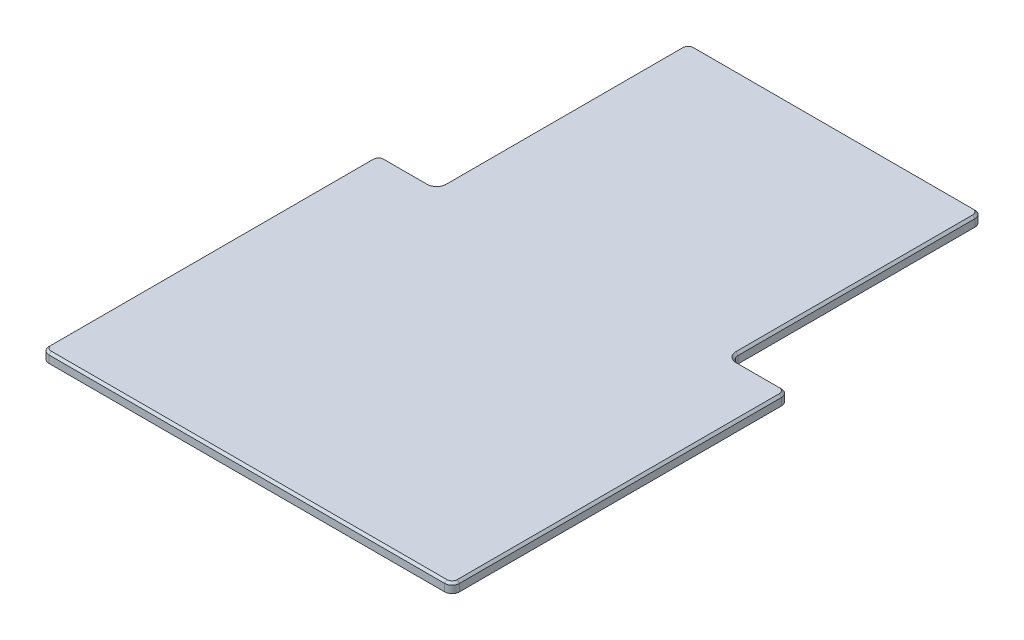
ISO-10303-21;
HEADER;
FILE_DESCRIPTION(('STEP AP214'),'2;1');
FILE_NAME('part.step','',(''),(''),'','','');
FILE_SCHEMA(('AUTOMOTIVE_DESIGN { 1 0 10303 214 1 1 1 1 }'));
ENDSEC;
DATA;
#1=APPLICATION_CONTEXT('core data for automotive mechanical design processes');
#2=APPLICATION_PROTOCOL_DEFINITION('international standard','automotive_design',2000,#1);
#3=PRODUCT_CONTEXT('',#1,'mechanical');
#4=PRODUCT('Part','Part','',(#3));
#5=PRODUCT_RELATED_PRODUCT_CATEGORY('part','',(#4));
#6=PRODUCT_DEFINITION_FORMATION('','',#4);
#7=PRODUCT_DEFINITION_CONTEXT('part definition',#1,'design');
#8=PRODUCT_DEFINITION('design','',#6,#7);
#9=PRODUCT_DEFINITION_SHAPE('','',#8);
#10=(LENGTH_UNIT() NAMED_UNIT(*) SI_UNIT(.MILLI.,.METRE.));
#11=(NAMED_UNIT(*) PLANE_ANGLE_UNIT() SI_UNIT($,.RADIAN.));
#12=(NAMED_UNIT(*) SI_UNIT($,.STERADIAN.) SOLID_ANGLE_UNIT());
#13=UNCERTAINTY_MEASURE_WITH_UNIT(LENGTH_MEASURE(1.E-05),#10,'distance_accuracy_value','');
#14=(GEOMETRIC_REPRESENTATION_CONTEXT(3) GLOBAL_UNCERTAINTY_ASSIGNED_CONTEXT((#13)) GLOBAL_UNIT_ASSIGNED_CONTEXT((#10,
#11,#12)) REPRESENTATION_CONTEXT('',''));
#15=CARTESIAN_POINT('',(0.,0.,0.));
#16=DIRECTION('',(0.,0.,1.));
#17=DIRECTION('',(1.,0.,0.));
#18=AXIS2_PLACEMENT_3D('',#15,#16,#17);
#19=CARTESIAN_POINT('',(469.,13.,-790.));
#20=DIRECTION('',(0.,-1.,0.));
#21=DIRECTION('',(0.,0.,-1.));
#22=AXIS2_PLACEMENT_3D('',#19,#20,#21);
#23=CYLINDRICAL_SURFACE('',#22,10.);
#24=DIRECTION('',(0.,-1.,0.));
#25=VECTOR('',#24,1.);
#26=CARTESIAN_POINT('',(469.,13.,-800.));
#27=LINE('',#26,#25);
#28=CARTESIAN_POINT('',(469.,10.0000000000002,-800.));
#29=VERTEX_POINT('',#28);
#30=CARTESIAN_POINT('',(469.,0.,-800.));
#31=VERTEX_POINT('',#30);
#32=EDGE_CURVE('E192',#29,#31,#27,.T.);
#33=ORIENTED_EDGE('',*,*,#32,.F.);
#34=CARTESIAN_POINT('',(469.,10.0000000000002,-790.));
#35=DIRECTION('',(0.,-1.,0.));
#36=DIRECTION('',(0.,0.,-1.));
#37=AXIS2_PLACEMENT_3D('',#34,#35,#36);
#38=CIRCLE('',#37,10.);
#39=CARTESIAN_POINT('',(479.,10.0000000000002,-790.));
#40=VERTEX_POINT('',#39);
#41=EDGE_CURVE('E345',#29,#40,#38,.T.);
#42=ORIENTED_EDGE('',*,*,#41,.T.);
#43=DIRECTION('',(0.,-1.,0.));
#44=VECTOR('',#43,1.);
#45=CARTESIAN_POINT('',(479.,13.,-790.));
#46=LINE('',#45,#44);
#47=CARTESIAN_POINT('',(479.,0.,-790.));
#48=VERTEX_POINT('',#47);
#49=EDGE_CURVE('E213',#40,#48,#46,.T.);
#50=ORIENTED_EDGE('',*,*,#49,.T.);
#51=CARTESIAN_POINT('',(469.,0.,-790.));
#52=DIRECTION('',(0.,1.,0.));
#53=DIRECTION('',(0.,0.,-1.));
#54=AXIS2_PLACEMENT_3D('',#51,#52,#53);
#55=CIRCLE('',#54,10.);
#56=EDGE_CURVE('E207',#48,#31,#55,.T.);
#57=ORIENTED_EDGE('',*,*,#56,.T.);
#58=EDGE_LOOP('',(#33,#42,#50,#57));
#59=FACE_BOUND('',#58,.T.);
#60=ADVANCED_FACE('F33',(#59),#23,.T.);
#61=CARTESIAN_POINT('',(89.0000000000001,13.,-800.));
#62=DIRECTION('',(0.,0.,1.));
#63=DIRECTION('',(1.,0.,0.));
#64=AXIS2_PLACEMENT_3D('',#61,#62,#63);
#65=PLANE('',#64);
#66=DIRECTION('',(0.,-1.,0.));
#67=VECTOR('',#66,1.);
#68=CARTESIAN_POINT('',(89.0000000000001,13.,-800.));
#69=LINE('',#68,#67);
#70=CARTESIAN_POINT('',(89.0000000000001,10.0000000000002,-800.));
#71=VERTEX_POINT('',#70);
#72=CARTESIAN_POINT('',(89.0000000000001,0.,-800.));
#73=VERTEX_POINT('',#72);
#74=EDGE_CURVE('E201',#71,#73,#69,.T.);
#75=ORIENTED_EDGE('',*,*,#74,.F.);
#76=DIRECTION('',(1.,0.,0.));
#77=VECTOR('',#76,1.);
#78=CARTESIAN_POINT('',(89.0000000000001,10.0000000000002,-800.));
#79=LINE('',#78,#77);
#80=EDGE_CURVE('E11',#71,#29,#79,.T.);
#81=ORIENTED_EDGE('',*,*,#80,.T.);
#82=ORIENTED_EDGE('',*,*,#32,.T.);
#83=DIRECTION('',(-1.,0.,0.));
#84=VECTOR('',#83,1.);
#85=CARTESIAN_POINT('',(89.0000000000001,0.,-800.));
#86=LINE('',#85,#84);
#87=EDGE_CURVE('E195',#31,#73,#86,.T.);
#88=ORIENTED_EDGE('',*,*,#87,.T.);
#89=EDGE_LOOP('',(#75,#81,#82,#88));
#90=FACE_BOUND('',#89,.T.);
#91=ADVANCED_FACE('F194',(#90),#65,.F.);
#92=CARTESIAN_POINT('',(89.,13.,-790.));
#93=DIRECTION('',(0.,-1.,0.));
#94=DIRECTION('',(0.,0.,-1.));
#95=AXIS2_PLACEMENT_3D('',#92,#93,#94);
#96=CYLINDRICAL_SURFACE('',#95,10.);
#97=DIRECTION('',(0.,-1.,0.));
#98=VECTOR('',#97,1.);
#99=CARTESIAN_POINT('',(79.,13.,-790.));
#100=LINE('',#99,#98);
#101=CARTESIAN_POINT('',(79.,10.0000000000002,-790.));
#102=VERTEX_POINT('',#101);
#103=CARTESIAN_POINT('',(79.,0.,-790.));
#104=VERTEX_POINT('',#103);
#105=EDGE_CURVE('E283',#102,#104,#100,.T.);
#106=ORIENTED_EDGE('',*,*,#105,.F.);
#107=CARTESIAN_POINT('',(89.,10.0000000000002,-790.));
#108=DIRECTION('',(0.,-1.,0.));
#109=DIRECTION('',(0.,0.,-1.));
#110=AXIS2_PLACEMENT_3D('',#107,#108,#109);
#111=CIRCLE('',#110,10.);
#112=EDGE_CURVE('E42',#102,#71,#111,.T.);
#113=ORIENTED_EDGE('',*,*,#112,.T.);
#114=ORIENTED_EDGE('',*,*,#74,.T.);
#115=CARTESIAN_POINT('',(89.,0.,-790.));
#116=DIRECTION('',(0.,1.,0.));
#117=DIRECTION('',(0.,0.,-1.));
#118=AXIS2_PLACEMENT_3D('',#115,#116,#117);
#119=CIRCLE('',#118,10.);
#120=EDGE_CURVE('E210',#73,#104,#119,.T.);
#121=ORIENTED_EDGE('',*,*,#120,.T.);
#122=EDGE_LOOP('',(#106,#113,#114,#121));
#123=FACE_BOUND('',#122,.T.);
#124=ADVANCED_FACE('F522',(#123),#96,.T.);
#125=CARTESIAN_POINT('',(79.,13.,-468.));
#126=DIRECTION('',(1.,0.,0.));
#127=DIRECTION('',(0.,0.,-1.));
#128=AXIS2_PLACEMENT_3D('',#125,#126,#127);
#129=PLANE('',#128);
#130=DIRECTION('',(0.,-1.,0.));
#131=VECTOR('',#130,1.);
#132=CARTESIAN_POINT('',(79.,13.,-468.));
#133=LINE('',#132,#131);
#134=CARTESIAN_POINT('',(79.,10.0000000000002,-468.));
#135=VERTEX_POINT('',#134);
#136=CARTESIAN_POINT('',(79.,0.,-468.));
#137=VERTEX_POINT('',#136);
#138=EDGE_CURVE('E281',#135,#137,#133,.T.);
#139=ORIENTED_EDGE('',*,*,#138,.F.);
#140=DIRECTION('',(0.,0.,-1.));
#141=VECTOR('',#140,1.);
#142=CARTESIAN_POINT('',(79.,10.,-468.));
#143=LINE('',#142,#141);
#144=EDGE_CURVE('E329',#135,#102,#143,.T.);
#145=ORIENTED_EDGE('',*,*,#144,.T.);
#146=ORIENTED_EDGE('',*,*,#105,.T.);
#147=DIRECTION('',(0.,0.,1.));
#148=VECTOR('',#147,1.);
#149=CARTESIAN_POINT('',(79.,0.,-468.));
#150=LINE('',#149,#148);
#151=EDGE_CURVE('E220',#104,#137,#150,.T.);
#152=ORIENTED_EDGE('',*,*,#151,.T.);
#153=EDGE_LOOP('',(#139,#145,#146,#152));
#154=FACE_BOUND('',#153,.T.);
#155=ADVANCED_FACE('F418',(#154),#129,.F.);
#156=CARTESIAN_POINT('',(69.,13.,-468.));
#157=DIRECTION('',(0.,-1.,0.));
#158=DIRECTION('',(0.,0.,-1.));
#159=AXIS2_PLACEMENT_3D('',#156,#157,#158);
#160=CYLINDRICAL_SURFACE('',#159,10.);
#161=DIRECTION('',(0.,-1.,0.));
#162=VECTOR('',#161,1.);
#163=CARTESIAN_POINT('',(68.9999999999999,13.,-458.));
#164=LINE('',#163,#162);
#165=CARTESIAN_POINT('',(68.9999999999999,10.0000000000002,-458.));
#166=VERTEX_POINT('',#165);
#167=CARTESIAN_POINT('',(68.9999999999999,0.,-458.));
#168=VERTEX_POINT('',#167);
#169=EDGE_CURVE('E279',#166,#168,#164,.T.);
#170=ORIENTED_EDGE('',*,*,#169,.F.);
#171=CARTESIAN_POINT('',(69.,10.0000000000002,-468.));
#172=DIRECTION('',(0.,-1.,0.));
#173=DIRECTION('',(0.,0.,-1.));
#174=AXIS2_PLACEMENT_3D('',#171,#172,#173);
#175=CIRCLE('',#174,10.);
#176=EDGE_CURVE('E343',#166,#135,#175,.F.);
#177=ORIENTED_EDGE('',*,*,#176,.T.);
#178=ORIENTED_EDGE('',*,*,#138,.T.);
#179=CARTESIAN_POINT('',(69.,0.,-468.));
#180=DIRECTION('',(0.,-1.,0.));
#181=DIRECTION('',(0.,0.,1.));
#182=AXIS2_PLACEMENT_3D('',#179,#180,#181);
#183=CIRCLE('',#182,10.);
#184=EDGE_CURVE('E223',#137,#168,#183,.T.);
#185=ORIENTED_EDGE('',*,*,#184,.T.);
#186=EDGE_LOOP('',(#170,#177,#178,#185));
#187=FACE_BOUND('',#186,.T.);
#188=ADVANCED_FACE('F416',(#187),#160,.F.);
#189=CARTESIAN_POINT('',(10.0000000000001,13.,-458.));
#190=DIRECTION('',(0.,0.,1.));
#191=DIRECTION('',(1.,0.,0.));
#192=AXIS2_PLACEMENT_3D('',#189,#190,#191);
#193=PLANE('',#192);
#194=DIRECTION('',(0.,-1.,0.));
#195=VECTOR('',#194,1.);
#196=CARTESIAN_POINT('',(10.0000000000001,13.,-458.));
#197=LINE('',#196,#195);
#198=CARTESIAN_POINT('',(10.0000000000001,10.0000000000002,-458.));
#199=VERTEX_POINT('',#198);
#200=CARTESIAN_POINT('',(10.0000000000001,0.,-458.));
#201=VERTEX_POINT('',#200);
#202=EDGE_CURVE('E277',#199,#201,#197,.T.);
#203=ORIENTED_EDGE('',*,*,#202,.F.);
#204=DIRECTION('',(1.,0.,0.));
#205=VECTOR('',#204,1.);
#206=CARTESIAN_POINT('',(10.0000000000001,10.0000000000002,-458.));
#207=LINE('',#206,#205);
#208=EDGE_CURVE('E339',#199,#166,#207,.T.);
#209=ORIENTED_EDGE('',*,*,#208,.T.);
#210=ORIENTED_EDGE('',*,*,#169,.T.);
#211=DIRECTION('',(-1.,0.,0.));
#212=VECTOR('',#211,1.);
#213=CARTESIAN_POINT('',(10.0000000000001,0.,-458.));
#214=LINE('',#213,#212);
#215=EDGE_CURVE('E226',#168,#201,#214,.T.);
#216=ORIENTED_EDGE('',*,*,#215,.T.);
#217=EDGE_LOOP('',(#203,#209,#210,#216));
#218=FACE_BOUND('',#217,.T.);
#219=ADVANCED_FACE('F425',(#218),#193,.F.);
#220=CARTESIAN_POINT('',(10.,13.,-448.));
#221=DIRECTION('',(0.,-1.,0.));
#222=DIRECTION('',(0.,0.,-1.));
#223=AXIS2_PLACEMENT_3D('',#220,#221,#222);
#224=CYLINDRICAL_SURFACE('',#223,10.);
#225=DIRECTION('',(0.,-1.,0.));
#226=VECTOR('',#225,1.);
#227=CARTESIAN_POINT('',(0.,13.,-448.));
#228=LINE('',#227,#226);
#229=CARTESIAN_POINT('',(0.,10.0000000000002,-448.));
#230=VERTEX_POINT('',#229);
#231=CARTESIAN_POINT('',(0.,0.,-448.));
#232=VERTEX_POINT('',#231);
#233=EDGE_CURVE('E275',#230,#232,#228,.T.);
#234=ORIENTED_EDGE('',*,*,#233,.F.);
#235=CARTESIAN_POINT('',(10.,10.0000000000002,-448.));
#236=DIRECTION('',(0.,-1.,0.));
#237=DIRECTION('',(0.,0.,-1.));
#238=AXIS2_PLACEMENT_3D('',#235,#236,#237);
#239=CIRCLE('',#238,10.);
#240=EDGE_CURVE('E337',#230,#199,#239,.T.);
#241=ORIENTED_EDGE('',*,*,#240,.T.);
#242=ORIENTED_EDGE('',*,*,#202,.T.);
#243=CARTESIAN_POINT('',(10.,0.,-448.));
#244=DIRECTION('',(0.,1.,0.));
#245=DIRECTION('',(0.,0.,-1.));
#246=AXIS2_PLACEMENT_3D('',#243,#244,#245);
#247=CIRCLE('',#246,10.);
#248=EDGE_CURVE('E229',#201,#232,#247,.T.);
#249=ORIENTED_EDGE('',*,*,#248,.T.);
#250=EDGE_LOOP('',(#234,#241,#242,#249));
#251=FACE_BOUND('',#250,.T.);
#252=ADVANCED_FACE('F428',(#251),#224,.T.);
#253=CARTESIAN_POINT('',(0.,13.,-10.0000000000001));
#254=DIRECTION('',(1.,0.,0.));
#255=DIRECTION('',(0.,0.,-1.));
#256=AXIS2_PLACEMENT_3D('',#253,#254,#255);
#257=PLANE('',#256);
#258=DIRECTION('',(0.,-1.,0.));
#259=VECTOR('',#258,1.);
#260=CARTESIAN_POINT('',(0.,13.,-10.0000000000001));
#261=LINE('',#260,#259);
#262=CARTESIAN_POINT('',(0.,10.0000000000002,-10.0000000000001));
#263=VERTEX_POINT('',#262);
#264=CARTESIAN_POINT('',(0.,0.,-10.0000000000001));
#265=VERTEX_POINT('',#264);
#266=EDGE_CURVE('E273',#263,#265,#261,.T.);
#267=ORIENTED_EDGE('',*,*,#266,.F.);
#268=DIRECTION('',(0.,0.,-1.));
#269=VECTOR('',#268,1.);
#270=CARTESIAN_POINT('',(0.,10.,-10.0000000000001));
#271=LINE('',#270,#269);
#272=EDGE_CURVE('E327',#263,#230,#271,.T.);
#273=ORIENTED_EDGE('',*,*,#272,.T.);
#274=ORIENTED_EDGE('',*,*,#233,.T.);
#275=DIRECTION('',(0.,0.,1.));
#276=VECTOR('',#275,1.);
#277=CARTESIAN_POINT('',(0.,0.,-10.0000000000001));
#278=LINE('',#277,#276);
#279=EDGE_CURVE('E232',#232,#265,#278,.T.);
#280=ORIENTED_EDGE('',*,*,#279,.T.);
#281=EDGE_LOOP('',(#267,#273,#274,#280));
#282=FACE_BOUND('',#281,.T.);
#283=ADVANCED_FACE('F431',(#282),#257,.F.);
#284=CARTESIAN_POINT('',(10.,13.,-10.));
#285=DIRECTION('',(0.,-1.,0.));
#286=DIRECTION('',(0.,0.,-1.));
#287=AXIS2_PLACEMENT_3D('',#284,#285,#286);
#288=CYLINDRICAL_SURFACE('',#287,10.);
#289=DIRECTION('',(0.,-1.,0.));
#290=VECTOR('',#289,1.);
#291=CARTESIAN_POINT('',(10.0000000000001,13.,0.));
#292=LINE('',#291,#290);
#293=CARTESIAN_POINT('',(10.0000000000001,10.0000000000002,0.));
#294=VERTEX_POINT('',#293);
#295=CARTESIAN_POINT('',(10.0000000000001,0.,0.));
#296=VERTEX_POINT('',#295);
#297=EDGE_CURVE('E271',#294,#296,#292,.T.);
#298=ORIENTED_EDGE('',*,*,#297,.F.);
#299=CARTESIAN_POINT('',(10.,10.0000000000002,-10.));
#300=DIRECTION('',(0.,-1.,0.));
#301=DIRECTION('',(0.,0.,-1.));
#302=AXIS2_PLACEMENT_3D('',#299,#300,#301);
#303=CIRCLE('',#302,10.);
#304=EDGE_CURVE('E333',#294,#263,#303,.T.);
#305=ORIENTED_EDGE('',*,*,#304,.T.);
#306=ORIENTED_EDGE('',*,*,#266,.T.);
#307=CARTESIAN_POINT('',(10.,0.,-10.));
#308=DIRECTION('',(0.,1.,0.));
#309=DIRECTION('',(0.,0.,-1.));
#310=AXIS2_PLACEMENT_3D('',#307,#308,#309);
#311=CIRCLE('',#310,10.);
#312=EDGE_CURVE('E235',#265,#296,#311,.T.);
#313=ORIENTED_EDGE('',*,*,#312,.T.);
#314=EDGE_LOOP('',(#298,#305,#306,#313));
#315=FACE_BOUND('',#314,.T.);
#316=ADVANCED_FACE('F435',(#315),#288,.T.);
#317=CARTESIAN_POINT('',(10.0000000000001,13.,0.));
#318=DIRECTION('',(0.,0.,-1.));
#319=DIRECTION('',(-1.,0.,0.));
#320=AXIS2_PLACEMENT_3D('',#317,#318,#319);
#321=PLANE('',#320);
#322=DIRECTION('',(0.,-1.,0.));
#323=VECTOR('',#322,1.);
#324=CARTESIAN_POINT('',(548.,13.,0.));
#325=LINE('',#324,#323);
#326=CARTESIAN_POINT('',(548.,10.0000000000002,0.));
#327=VERTEX_POINT('',#326);
#328=CARTESIAN_POINT('',(548.,0.,0.));
#329=VERTEX_POINT('',#328);
#330=EDGE_CURVE('E269',#327,#329,#325,.T.);
#331=ORIENTED_EDGE('',*,*,#330,.F.);
#332=DIRECTION('',(-1.,0.,0.));
#333=VECTOR('',#332,1.);
#334=CARTESIAN_POINT('',(10.0000000000001,10.,0.));
#335=LINE('',#334,#333);
#336=EDGE_CURVE('E325',#327,#294,#335,.T.);
#337=ORIENTED_EDGE('',*,*,#336,.T.);
#338=ORIENTED_EDGE('',*,*,#297,.T.);
#339=DIRECTION('',(1.,0.,0.));
#340=VECTOR('',#339,1.);
#341=CARTESIAN_POINT('',(10.0000000000001,0.,0.));
#342=LINE('',#341,#340);
#343=EDGE_CURVE('E238',#296,#329,#342,.T.);
#344=ORIENTED_EDGE('',*,*,#343,.T.);
#345=EDGE_LOOP('',(#331,#337,#338,#344));
#346=FACE_BOUND('',#345,.T.);
#347=ADVANCED_FACE('F508',(#346),#321,.F.);
#348=CARTESIAN_POINT('',(548.,13.,-10.));
#349=DIRECTION('',(0.,-1.,0.));
#350=DIRECTION('',(0.,0.,-1.));
#351=AXIS2_PLACEMENT_3D('',#348,#349,#350);
#352=CYLINDRICAL_SURFACE('',#351,10.);
#353=DIRECTION('',(0.,-1.,0.));
#354=VECTOR('',#353,1.);
#355=CARTESIAN_POINT('',(558.,13.,-10.0000000000001));
#356=LINE('',#355,#354);
#357=CARTESIAN_POINT('',(558.,10.0000000000002,-10.0000000000001));
#358=VERTEX_POINT('',#357);
#359=CARTESIAN_POINT('',(558.,0.,-10.0000000000001));
#360=VERTEX_POINT('',#359);
#361=EDGE_CURVE('E267',#358,#360,#356,.T.);
#362=ORIENTED_EDGE('',*,*,#361,.F.);
#363=CARTESIAN_POINT('',(548.,10.0000000000002,-10.));
#364=DIRECTION('',(0.,-1.,0.));
#365=DIRECTION('',(0.,0.,-1.));
#366=AXIS2_PLACEMENT_3D('',#363,#364,#365);
#367=CIRCLE('',#366,10.);
#368=EDGE_CURVE('E331',#358,#327,#367,.T.);
#369=ORIENTED_EDGE('',*,*,#368,.T.);
#370=ORIENTED_EDGE('',*,*,#330,.T.);
#371=CARTESIAN_POINT('',(548.,0.,-10.));
#372=DIRECTION('',(0.,1.,0.));
#373=DIRECTION('',(0.,0.,1.));
#374=AXIS2_PLACEMENT_3D('',#371,#372,#373);
#375=CIRCLE('',#374,10.);
#376=EDGE_CURVE('E241',#329,#360,#375,.T.);
#377=ORIENTED_EDGE('',*,*,#376,.T.);
#378=EDGE_LOOP('',(#362,#369,#370,#377));
#379=FACE_BOUND('',#378,.T.);
#380=ADVANCED_FACE('F505',(#379),#352,.T.);
#381=CARTESIAN_POINT('',(558.,13.,-10.0000000000001));
#382=DIRECTION('',(-1.,0.,0.));
#383=DIRECTION('',(0.,0.,1.));
#384=AXIS2_PLACEMENT_3D('',#381,#382,#383);
#385=PLANE('',#384);
#386=DIRECTION('',(0.,-1.,0.));
#387=VECTOR('',#386,1.);
#388=CARTESIAN_POINT('',(558.,13.,-448.));
#389=LINE('',#388,#387);
#390=CARTESIAN_POINT('',(558.,10.0000000000002,-448.));
#391=VERTEX_POINT('',#390);
#392=CARTESIAN_POINT('',(558.,0.,-448.));
#393=VERTEX_POINT('',#392);
#394=EDGE_CURVE('E265',#391,#393,#389,.T.);
#395=ORIENTED_EDGE('',*,*,#394,.F.);
#396=DIRECTION('',(0.,0.,1.));
#397=VECTOR('',#396,1.);
#398=CARTESIAN_POINT('',(558.,10.0000000000002,-10.0000000000001));
#399=LINE('',#398,#397);
#400=EDGE_CURVE('E323',#391,#358,#399,.T.);
#401=ORIENTED_EDGE('',*,*,#400,.T.);
#402=ORIENTED_EDGE('',*,*,#361,.T.);
#403=DIRECTION('',(0.,0.,-1.));
#404=VECTOR('',#403,1.);
#405=CARTESIAN_POINT('',(558.,0.,-10.0000000000001));
#406=LINE('',#405,#404);
#407=EDGE_CURVE('E244',#360,#393,#406,.T.);
#408=ORIENTED_EDGE('',*,*,#407,.T.);
#409=EDGE_LOOP('',(#395,#401,#402,#408));
#410=FACE_BOUND('',#409,.T.);
#411=ADVANCED_FACE('F502',(#410),#385,.F.);
#412=CARTESIAN_POINT('',(548.,13.,-448.));
#413=DIRECTION('',(0.,-1.,0.));
#414=DIRECTION('',(0.,0.,-1.));
#415=AXIS2_PLACEMENT_3D('',#412,#413,#414);
#416=CYLINDRICAL_SURFACE('',#415,10.);
#417=DIRECTION('',(0.,-1.,0.));
#418=VECTOR('',#417,1.);
#419=CARTESIAN_POINT('',(548.,13.,-458.));
#420=LINE('',#419,#418);
#421=CARTESIAN_POINT('',(548.,10.0000000000002,-458.));
#422=VERTEX_POINT('',#421);
#423=CARTESIAN_POINT('',(548.,0.,-458.));
#424=VERTEX_POINT('',#423);
#425=EDGE_CURVE('E263',#422,#424,#420,.T.);
#426=ORIENTED_EDGE('',*,*,#425,.F.);
#427=CARTESIAN_POINT('',(548.,10.0000000000002,-448.));
#428=DIRECTION('',(0.,-1.,0.));
#429=DIRECTION('',(0.,0.,-1.));
#430=AXIS2_PLACEMENT_3D('',#427,#428,#429);
#431=CIRCLE('',#430,10.);
#432=EDGE_CURVE('E335',#422,#391,#431,.T.);
#433=ORIENTED_EDGE('',*,*,#432,.T.);
#434=ORIENTED_EDGE('',*,*,#394,.T.);
#435=CARTESIAN_POINT('',(548.,0.,-448.));
#436=DIRECTION('',(0.,1.,0.));
#437=DIRECTION('',(0.,0.,-1.));
#438=AXIS2_PLACEMENT_3D('',#435,#436,#437);
#439=CIRCLE('',#438,10.);
#440=EDGE_CURVE('E247',#393,#424,#439,.T.);
#441=ORIENTED_EDGE('',*,*,#440,.T.);
#442=EDGE_LOOP('',(#426,#433,#434,#441));
#443=FACE_BOUND('',#442,.T.);
#444=ADVANCED_FACE('F497',(#443),#416,.T.);
#445=CARTESIAN_POINT('',(489.,13.,-458.));
#446=DIRECTION('',(0.,0.,1.));
#447=DIRECTION('',(1.,0.,0.));
#448=AXIS2_PLACEMENT_3D('',#445,#446,#447);
#449=PLANE('',#448);
#450=DIRECTION('',(0.,-1.,0.));
#451=VECTOR('',#450,1.);
#452=CARTESIAN_POINT('',(489.,13.,-458.));
#453=LINE('',#452,#451);
#454=CARTESIAN_POINT('',(489.,10.0000000000002,-458.));
#455=VERTEX_POINT('',#454);
#456=CARTESIAN_POINT('',(489.,0.,-458.));
#457=VERTEX_POINT('',#456);
#458=EDGE_CURVE('E261',#455,#457,#453,.T.);
#459=ORIENTED_EDGE('',*,*,#458,.F.);
#460=DIRECTION('',(1.,0.,0.));
#461=VECTOR('',#460,1.);
#462=CARTESIAN_POINT('',(489.,10.0000000000002,-458.));
#463=LINE('',#462,#461);
#464=EDGE_CURVE('E321',#455,#422,#463,.T.);
#465=ORIENTED_EDGE('',*,*,#464,.T.);
#466=ORIENTED_EDGE('',*,*,#425,.T.);
#467=DIRECTION('',(-1.,0.,0.));
#468=VECTOR('',#467,1.);
#469=CARTESIAN_POINT('',(489.,0.,-458.));
#470=LINE('',#469,#468);
#471=EDGE_CURVE('E250',#424,#457,#470,.T.);
#472=ORIENTED_EDGE('',*,*,#471,.T.);
#473=EDGE_LOOP('',(#459,#465,#466,#472));
#474=FACE_BOUND('',#473,.T.);
#475=ADVANCED_FACE('F494',(#474),#449,.F.);
#476=CARTESIAN_POINT('',(489.,13.,-468.));
#477=DIRECTION('',(0.,-1.,0.));
#478=DIRECTION('',(0.,0.,-1.));
#479=AXIS2_PLACEMENT_3D('',#476,#477,#478);
#480=CYLINDRICAL_SURFACE('',#479,10.);
#481=DIRECTION('',(0.,-1.,0.));
#482=VECTOR('',#481,1.);
#483=CARTESIAN_POINT('',(479.,13.,-468.));
#484=LINE('',#483,#482);
#485=CARTESIAN_POINT('',(479.,10.0000000000002,-468.));
#486=VERTEX_POINT('',#485);
#487=CARTESIAN_POINT('',(479.,0.,-468.));
#488=VERTEX_POINT('',#487);
#489=EDGE_CURVE('E259',#486,#488,#484,.T.);
#490=ORIENTED_EDGE('',*,*,#489,.F.);
#491=CARTESIAN_POINT('',(489.,10.0000000000002,-468.));
#492=DIRECTION('',(0.,-1.,0.));
#493=DIRECTION('',(0.,0.,-1.));
#494=AXIS2_PLACEMENT_3D('',#491,#492,#493);
#495=CIRCLE('',#494,10.);
#496=EDGE_CURVE('E341',#486,#455,#495,.F.);
#497=ORIENTED_EDGE('',*,*,#496,.T.);
#498=ORIENTED_EDGE('',*,*,#458,.T.);
#499=CARTESIAN_POINT('',(489.,0.,-468.));
#500=DIRECTION('',(0.,-1.,0.));
#501=DIRECTION('',(0.,0.,1.));
#502=AXIS2_PLACEMENT_3D('',#499,#500,#501);
#503=CIRCLE('',#502,10.);
#504=EDGE_CURVE('E253',#457,#488,#503,.T.);
#505=ORIENTED_EDGE('',*,*,#504,.T.);
#506=EDGE_LOOP('',(#490,#497,#498,#505));
#507=FACE_BOUND('',#506,.T.);
#508=ADVANCED_FACE('F491',(#507),#480,.F.);
#509=CARTESIAN_POINT('',(479.,13.,-468.));
#510=DIRECTION('',(-1.,0.,0.));
#511=DIRECTION('',(0.,0.,1.));
#512=AXIS2_PLACEMENT_3D('',#509,#510,#511);
#513=PLANE('',#512);
#514=ORIENTED_EDGE('',*,*,#49,.F.);
#515=DIRECTION('',(0.,0.,1.));
#516=VECTOR('',#515,1.);
#517=CARTESIAN_POINT('',(479.,9.99999999999989,-468.));
#518=LINE('',#517,#516);
#519=EDGE_CURVE('E318',#40,#486,#518,.T.);
#520=ORIENTED_EDGE('',*,*,#519,.T.);
#521=ORIENTED_EDGE('',*,*,#489,.T.);
#522=DIRECTION('',(0.,0.,-1.));
#523=VECTOR('',#522,1.);
#524=CARTESIAN_POINT('',(479.,0.,-468.));
#525=LINE('',#524,#523);
#526=EDGE_CURVE('E256',#488,#48,#525,.T.);
#527=ORIENTED_EDGE('',*,*,#526,.T.);
#528=EDGE_LOOP('',(#514,#520,#521,#527));
#529=FACE_BOUND('',#528,.T.);
#530=ADVANCED_FACE('F485',(#529),#513,.F.);
#531=CARTESIAN_POINT('',(469.,13.,-790.));
#532=DIRECTION('',(0.,-1.,0.));
#533=DIRECTION('',(0.,0.,-1.));
#534=AXIS2_PLACEMENT_3D('',#531,#532,#533);
#535=PLANE('',#534);
#536=DIRECTION('',(1.,0.,0.));
#537=VECTOR('',#536,1.);
#538=CARTESIAN_POINT('',(469.,13.,-3.));
#539=LINE('',#538,#537);
#540=CARTESIAN_POINT('',(10.0000000000001,13.,-2.99999999999978));
#541=VERTEX_POINT('',#540);
#542=CARTESIAN_POINT('',(548.,13.,-3.));
#543=VERTEX_POINT('',#542);
#544=EDGE_CURVE('E312',#541,#543,#539,.T.);
#545=ORIENTED_EDGE('',*,*,#544,.T.);
#546=CARTESIAN_POINT('',(548.,13.,-10.));
#547=DIRECTION('',(0.,-1.,0.));
#548=DIRECTION('',(0.,0.,-1.));
#549=AXIS2_PLACEMENT_3D('',#546,#547,#548);
#550=CIRCLE('',#549,7.00000000000023);
#551=CARTESIAN_POINT('',(555.,13.,-10.0000000000001));
#552=VERTEX_POINT('',#551);
#553=EDGE_CURVE('E316',#543,#552,#550,.F.);
#554=ORIENTED_EDGE('',*,*,#553,.T.);
#555=DIRECTION('',(0.,0.,-1.));
#556=VECTOR('',#555,1.);
#557=CARTESIAN_POINT('',(555.,13.,-790.));
#558=LINE('',#557,#556);
#559=CARTESIAN_POINT('',(555.,13.,-448.));
#560=VERTEX_POINT('',#559);
#561=EDGE_CURVE('E314',#552,#560,#558,.T.);
#562=ORIENTED_EDGE('',*,*,#561,.T.);
#563=CARTESIAN_POINT('',(548.,13.,-448.));
#564=DIRECTION('',(0.,-1.,0.));
#565=DIRECTION('',(0.,0.,-1.));
#566=AXIS2_PLACEMENT_3D('',#563,#564,#565);
#567=CIRCLE('',#566,7.00000000000023);
#568=CARTESIAN_POINT('',(548.,13.,-455.));
#569=VERTEX_POINT('',#568);
#570=EDGE_CURVE('E308',#560,#569,#567,.F.);
#571=ORIENTED_EDGE('',*,*,#570,.T.);
#572=DIRECTION('',(-1.,0.,0.));
#573=VECTOR('',#572,1.);
#574=CARTESIAN_POINT('',(469.,13.,-455.));
#575=LINE('',#574,#573);
#576=CARTESIAN_POINT('',(489.,13.,-455.));
#577=VERTEX_POINT('',#576);
#578=EDGE_CURVE('E306',#569,#577,#575,.T.);
#579=ORIENTED_EDGE('',*,*,#578,.T.);
#580=CARTESIAN_POINT('',(489.,13.,-468.));
#581=DIRECTION('',(0.,-1.,0.));
#582=DIRECTION('',(0.,0.,-1.));
#583=AXIS2_PLACEMENT_3D('',#580,#581,#582);
#584=CIRCLE('',#583,12.9999999999998);
#585=CARTESIAN_POINT('',(476.,13.,-468.));
#586=VERTEX_POINT('',#585);
#587=EDGE_CURVE('E298',#577,#586,#584,.T.);
#588=ORIENTED_EDGE('',*,*,#587,.T.);
#589=DIRECTION('',(0.,0.,-1.));
#590=VECTOR('',#589,1.);
#591=CARTESIAN_POINT('',(476.,13.,-790.));
#592=LINE('',#591,#590);
#593=CARTESIAN_POINT('',(476.,13.,-790.));
#594=VERTEX_POINT('',#593);
#595=EDGE_CURVE('E293',#586,#594,#592,.T.);
#596=ORIENTED_EDGE('',*,*,#595,.T.);
#597=CARTESIAN_POINT('',(469.,13.,-790.));
#598=DIRECTION('',(0.,-1.,0.));
#599=DIRECTION('',(0.,0.,-1.));
#600=AXIS2_PLACEMENT_3D('',#597,#598,#599);
#601=CIRCLE('',#600,7.00000000000023);
#602=CARTESIAN_POINT('',(469.,13.,-797.));
#603=VERTEX_POINT('',#602);
#604=EDGE_CURVE('E289',#594,#603,#601,.F.);
#605=ORIENTED_EDGE('',*,*,#604,.T.);
#606=DIRECTION('',(-1.,0.,0.));
#607=VECTOR('',#606,1.);
#608=CARTESIAN_POINT('',(469.,13.,-797.));
#609=LINE('',#608,#607);
#610=CARTESIAN_POINT('',(89.0000000000001,13.,-797.));
#611=VERTEX_POINT('',#610);
#612=EDGE_CURVE('E200',#603,#611,#609,.T.);
#613=ORIENTED_EDGE('',*,*,#612,.T.);
#614=CARTESIAN_POINT('',(89.,13.,-790.));
#615=DIRECTION('',(0.,-1.,0.));
#616=DIRECTION('',(0.,0.,-1.));
#617=AXIS2_PLACEMENT_3D('',#614,#615,#616);
#618=CIRCLE('',#617,7.00000000000023);
#619=CARTESIAN_POINT('',(81.9999999999998,13.,-790.));
#620=VERTEX_POINT('',#619);
#621=EDGE_CURVE('E287',#611,#620,#618,.F.);
#622=ORIENTED_EDGE('',*,*,#621,.T.);
#623=DIRECTION('',(0.,0.,1.));
#624=VECTOR('',#623,1.);
#625=CARTESIAN_POINT('',(82.,13.,-790.));
#626=LINE('',#625,#624);
#627=CARTESIAN_POINT('',(82.,13.,-468.));
#628=VERTEX_POINT('',#627);
#629=EDGE_CURVE('E291',#620,#628,#626,.T.);
#630=ORIENTED_EDGE('',*,*,#629,.T.);
#631=CARTESIAN_POINT('',(69.,13.,-468.));
#632=DIRECTION('',(0.,-1.,0.));
#633=DIRECTION('',(0.,0.,-1.));
#634=AXIS2_PLACEMENT_3D('',#631,#632,#633);
#635=CIRCLE('',#634,12.9999999999998);
#636=CARTESIAN_POINT('',(68.9999999999999,13.,-455.));
#637=VERTEX_POINT('',#636);
#638=EDGE_CURVE('E296',#628,#637,#635,.T.);
#639=ORIENTED_EDGE('',*,*,#638,.T.);
#640=DIRECTION('',(-1.,0.,0.));
#641=VECTOR('',#640,1.);
#642=CARTESIAN_POINT('',(469.,13.,-455.));
#643=LINE('',#642,#641);
#644=CARTESIAN_POINT('',(10.,13.,-455.));
#645=VERTEX_POINT('',#644);
#646=EDGE_CURVE('E300',#637,#645,#643,.T.);
#647=ORIENTED_EDGE('',*,*,#646,.T.);
#648=CARTESIAN_POINT('',(10.,13.,-448.));
#649=DIRECTION('',(0.,-1.,0.));
#650=DIRECTION('',(0.,0.,-1.));
#651=AXIS2_PLACEMENT_3D('',#648,#649,#650);
#652=CIRCLE('',#651,7.00000000000023);
#653=CARTESIAN_POINT('',(2.99999999999977,13.,-448.));
#654=VERTEX_POINT('',#653);
#655=EDGE_CURVE('E302',#645,#654,#652,.F.);
#656=ORIENTED_EDGE('',*,*,#655,.T.);
#657=DIRECTION('',(0.,0.,1.));
#658=VECTOR('',#657,1.);
#659=CARTESIAN_POINT('',(3.,13.,-790.));
#660=LINE('',#659,#658);
#661=CARTESIAN_POINT('',(3.,13.,-10.0000000000001));
#662=VERTEX_POINT('',#661);
#663=EDGE_CURVE('E304',#654,#662,#660,.T.);
#664=ORIENTED_EDGE('',*,*,#663,.T.);
#665=CARTESIAN_POINT('',(10.,13.,-10.));
#666=DIRECTION('',(0.,-1.,0.));
#667=DIRECTION('',(0.,0.,-1.));
#668=AXIS2_PLACEMENT_3D('',#665,#666,#667);
#669=CIRCLE('',#668,7.00000000000022);
#670=EDGE_CURVE('E310',#662,#541,#669,.F.);
#671=ORIENTED_EDGE('',*,*,#670,.T.);
#672=EDGE_LOOP('',(#545,#554,#562,#571,#579,#588,#596,#605,#613,#622,#630,#639,#647,#656,#664,#671));
#673=FACE_BOUND('',#672,.T.);
#674=ADVANCED_FACE('F400',(#673),#535,.F.);
#675=CARTESIAN_POINT('',(469.,0.,-790.));
#676=DIRECTION('',(0.,-1.,0.));
#677=DIRECTION('',(0.,0.,-1.));
#678=AXIS2_PLACEMENT_3D('',#675,#676,#677);
#679=PLANE('',#678);
#680=ORIENTED_EDGE('',*,*,#56,.F.);
#681=ORIENTED_EDGE('',*,*,#526,.F.);
#682=ORIENTED_EDGE('',*,*,#504,.F.);
#683=ORIENTED_EDGE('',*,*,#471,.F.);
#684=ORIENTED_EDGE('',*,*,#440,.F.);
#685=ORIENTED_EDGE('',*,*,#407,.F.);
#686=ORIENTED_EDGE('',*,*,#376,.F.);
#687=ORIENTED_EDGE('',*,*,#343,.F.);
#688=ORIENTED_EDGE('',*,*,#312,.F.);
#689=ORIENTED_EDGE('',*,*,#279,.F.);
#690=ORIENTED_EDGE('',*,*,#248,.F.);
#691=ORIENTED_EDGE('',*,*,#215,.F.);
#692=ORIENTED_EDGE('',*,*,#184,.F.);
#693=ORIENTED_EDGE('',*,*,#151,.F.);
#694=ORIENTED_EDGE('',*,*,#120,.F.);
#695=ORIENTED_EDGE('',*,*,#87,.F.);
#696=EDGE_LOOP('',(#680,#681,#682,#683,#684,#685,#686,#687,#688,#689,#690,#691,#692,#693,#694,#695));
#697=FACE_BOUND('',#696,.T.);
#698=ADVANCED_FACE('F205',(#697),#679,.T.);
#699=CARTESIAN_POINT('',(3.,13.,-790.));
#700=DIRECTION('',(0.707106781186547,-0.707106781186547,0.));
#701=DIRECTION('',(0.707106781186548,0.707106781186548,0.));
#702=AXIS2_PLACEMENT_3D('',#699,#700,#701);
#703=PLANE('',#702);
#704=DIRECTION('',(0.707106781186547,0.707106781186547,0.));
#705=VECTOR('',#704,1.);
#706=CARTESIAN_POINT('',(0.,10.,-448.));
#707=LINE('',#706,#705);
#708=EDGE_CURVE('E217',#230,#654,#707,.T.);
#709=ORIENTED_EDGE('',*,*,#708,.F.);
#710=ORIENTED_EDGE('',*,*,#272,.F.);
#711=DIRECTION('',(-0.707106781186547,-0.707106781186547,0.));
#712=VECTOR('',#711,1.);
#713=CARTESIAN_POINT('',(3.,13.,-10.0000000000001));
#714=LINE('',#713,#712);
#715=EDGE_CURVE('E37',#662,#263,#714,.T.);
#716=ORIENTED_EDGE('',*,*,#715,.F.);
#717=ORIENTED_EDGE('',*,*,#663,.F.);
#718=EDGE_LOOP('',(#709,#710,#716,#717));
#719=FACE_BOUND('',#718,.T.);
#720=ADVANCED_FACE('F35',(#719),#703,.F.);
#721=CARTESIAN_POINT('',(10.,13.,-10.));
#722=DIRECTION('',(0.,-1.,0.));
#723=DIRECTION('',(0.,0.,-1.));
#724=AXIS2_PLACEMENT_3D('',#721,#722,#723);
#725=CONICAL_SURFACE('',#724,7.00000000000022,0.785398163397448);
#726=ORIENTED_EDGE('',*,*,#715,.T.);
#727=ORIENTED_EDGE('',*,*,#304,.F.);
#728=DIRECTION('',(0.,-0.707106781186547,0.707106781186547));
#729=VECTOR('',#728,1.);
#730=CARTESIAN_POINT('',(10.0000000000001,13.,-2.99999999999978));
#731=LINE('',#730,#729);
#732=EDGE_CURVE('E385',#541,#294,#731,.T.);
#733=ORIENTED_EDGE('',*,*,#732,.F.);
#734=ORIENTED_EDGE('',*,*,#670,.F.);
#735=EDGE_LOOP('',(#726,#727,#733,#734));
#736=FACE_BOUND('',#735,.T.);
#737=ADVANCED_FACE('F439',(#736),#725,.T.);
#738=CARTESIAN_POINT('',(10.,13.,-448.));
#739=DIRECTION('',(0.,-1.,0.));
#740=DIRECTION('',(0.,0.,-1.));
#741=AXIS2_PLACEMENT_3D('',#738,#739,#740);
#742=CONICAL_SURFACE('',#741,7.00000000000023,0.785398163397448);
#743=ORIENTED_EDGE('',*,*,#708,.T.);
#744=ORIENTED_EDGE('',*,*,#655,.F.);
#745=DIRECTION('',(0.,0.707106781186547,0.707106781186547));
#746=VECTOR('',#745,1.);
#747=CARTESIAN_POINT('',(10.0000000000001,10.0000000000002,-458.));
#748=LINE('',#747,#746);
#749=EDGE_CURVE('E382',#199,#645,#748,.T.);
#750=ORIENTED_EDGE('',*,*,#749,.F.);
#751=ORIENTED_EDGE('',*,*,#240,.F.);
#752=EDGE_LOOP('',(#743,#744,#750,#751));
#753=FACE_BOUND('',#752,.T.);
#754=ADVANCED_FACE('F392',(#753),#742,.T.);
#755=CARTESIAN_POINT('',(469.,13.,-3.));
#756=DIRECTION('',(0.,-0.707106781186547,-0.707106781186547));
#757=DIRECTION('',(0.,0.707106781186548,-0.707106781186548));
#758=AXIS2_PLACEMENT_3D('',#755,#756,#757);
#759=PLANE('',#758);
#760=ORIENTED_EDGE('',*,*,#732,.T.);
#761=ORIENTED_EDGE('',*,*,#336,.F.);
#762=DIRECTION('',(0.,-0.707106781186547,0.707106781186547));
#763=VECTOR('',#762,1.);
#764=CARTESIAN_POINT('',(548.,13.,-3.));
#765=LINE('',#764,#763);
#766=EDGE_CURVE('E379',#543,#327,#765,.T.);
#767=ORIENTED_EDGE('',*,*,#766,.F.);
#768=ORIENTED_EDGE('',*,*,#544,.F.);
#769=EDGE_LOOP('',(#760,#761,#767,#768));
#770=FACE_BOUND('',#769,.T.);
#771=ADVANCED_FACE('F443',(#770),#759,.F.);
#772=CARTESIAN_POINT('',(469.,13.,-455.));
#773=DIRECTION('',(0.,-0.707106781186547,0.707106781186547));
#774=DIRECTION('',(0.,-0.707106781186548,-0.707106781186548));
#775=AXIS2_PLACEMENT_3D('',#772,#773,#774);
#776=PLANE('',#775);
#777=ORIENTED_EDGE('',*,*,#749,.T.);
#778=ORIENTED_EDGE('',*,*,#646,.F.);
#779=DIRECTION('',(0.,0.707106781186547,0.707106781186547));
#780=VECTOR('',#779,1.);
#781=CARTESIAN_POINT('',(68.9999999999999,10.0000000000002,-458.));
#782=LINE('',#781,#780);
#783=EDGE_CURVE('E376',#166,#637,#782,.T.);
#784=ORIENTED_EDGE('',*,*,#783,.F.);
#785=ORIENTED_EDGE('',*,*,#208,.F.);
#786=EDGE_LOOP('',(#777,#778,#784,#785));
#787=FACE_BOUND('',#786,.T.);
#788=ADVANCED_FACE('F406',(#787),#776,.F.);
#789=CARTESIAN_POINT('',(548.,13.,-10.));
#790=DIRECTION('',(0.,-1.,0.));
#791=DIRECTION('',(0.,0.,-1.));
#792=AXIS2_PLACEMENT_3D('',#789,#790,#791);
#793=CONICAL_SURFACE('',#792,7.00000000000022,0.785398163397448);
#794=ORIENTED_EDGE('',*,*,#766,.T.);
#795=ORIENTED_EDGE('',*,*,#368,.F.);
#796=DIRECTION('',(0.707106781186547,-0.707106781186547,0.));
#797=VECTOR('',#796,1.);
#798=CARTESIAN_POINT('',(555.,13.,-10.0000000000001));
#799=LINE('',#798,#797);
#800=EDGE_CURVE('E373',#552,#358,#799,.T.);
#801=ORIENTED_EDGE('',*,*,#800,.F.);
#802=ORIENTED_EDGE('',*,*,#553,.F.);
#803=EDGE_LOOP('',(#794,#795,#801,#802));
#804=FACE_BOUND('',#803,.T.);
#805=ADVANCED_FACE('F451',(#804),#793,.T.);
#806=CARTESIAN_POINT('',(69.,13.,-468.));
#807=DIRECTION('',(0.,1.,0.));
#808=DIRECTION('',(0.,0.,1.));
#809=AXIS2_PLACEMENT_3D('',#806,#807,#808);
#810=CONICAL_SURFACE('',#809,12.9999999999998,0.785398163397447);
#811=ORIENTED_EDGE('',*,*,#783,.T.);
#812=ORIENTED_EDGE('',*,*,#638,.F.);
#813=DIRECTION('',(0.707106781186547,0.707106781186547,0.));
#814=VECTOR('',#813,1.);
#815=CARTESIAN_POINT('',(79.,10.0000000000002,-468.));
#816=LINE('',#815,#814);
#817=EDGE_CURVE('E370',#135,#628,#816,.T.);
#818=ORIENTED_EDGE('',*,*,#817,.F.);
#819=ORIENTED_EDGE('',*,*,#176,.F.);
#820=EDGE_LOOP('',(#811,#812,#818,#819));
#821=FACE_BOUND('',#820,.T.);
#822=ADVANCED_FACE('F410',(#821),#810,.F.);
#823=CARTESIAN_POINT('',(555.,13.,-790.));
#824=DIRECTION('',(-0.707106781186547,-0.707106781186547,0.));
#825=DIRECTION('',(0.707106781186548,-0.707106781186548,0.));
#826=AXIS2_PLACEMENT_3D('',#823,#824,#825);
#827=PLANE('',#826);
#828=ORIENTED_EDGE('',*,*,#800,.T.);
#829=ORIENTED_EDGE('',*,*,#400,.F.);
#830=DIRECTION('',(0.707106781186547,-0.707106781186547,0.));
#831=VECTOR('',#830,1.);
#832=CARTESIAN_POINT('',(555.,13.,-448.));
#833=LINE('',#832,#831);
#834=EDGE_CURVE('E367',#560,#391,#833,.T.);
#835=ORIENTED_EDGE('',*,*,#834,.F.);
#836=ORIENTED_EDGE('',*,*,#561,.F.);
#837=EDGE_LOOP('',(#828,#829,#835,#836));
#838=FACE_BOUND('',#837,.T.);
#839=ADVANCED_FACE('F454',(#838),#827,.F.);
#840=CARTESIAN_POINT('',(82.,13.,-790.));
#841=DIRECTION('',(0.707106781186546,-0.707106781186549,0.));
#842=DIRECTION('',(0.707106781186549,0.707106781186546,0.));
#843=AXIS2_PLACEMENT_3D('',#840,#841,#842);
#844=PLANE('',#843);
#845=ORIENTED_EDGE('',*,*,#817,.T.);
#846=ORIENTED_EDGE('',*,*,#629,.F.);
#847=DIRECTION('',(0.707106781186549,0.707106781186546,0.));
#848=VECTOR('',#847,1.);
#849=CARTESIAN_POINT('',(79.,10.,-790.));
#850=LINE('',#849,#848);
#851=EDGE_CURVE('E364',#102,#620,#850,.T.);
#852=ORIENTED_EDGE('',*,*,#851,.F.);
#853=ORIENTED_EDGE('',*,*,#144,.F.);
#854=EDGE_LOOP('',(#845,#846,#852,#853));
#855=FACE_BOUND('',#854,.T.);
#856=ADVANCED_FACE('F542',(#855),#844,.F.);
#857=CARTESIAN_POINT('',(548.,13.,-448.));
#858=DIRECTION('',(0.,-1.,0.));
#859=DIRECTION('',(0.,0.,-1.));
#860=AXIS2_PLACEMENT_3D('',#857,#858,#859);
#861=CONICAL_SURFACE('',#860,7.00000000000023,0.785398163397448);
#862=ORIENTED_EDGE('',*,*,#834,.T.);
#863=ORIENTED_EDGE('',*,*,#432,.F.);
#864=DIRECTION('',(0.,-0.707106781186547,-0.707106781186547));
#865=VECTOR('',#864,1.);
#866=CARTESIAN_POINT('',(548.,13.,-455.));
#867=LINE('',#866,#865);
#868=EDGE_CURVE('E361',#569,#422,#867,.T.);
#869=ORIENTED_EDGE('',*,*,#868,.F.);
#870=ORIENTED_EDGE('',*,*,#570,.F.);
#871=EDGE_LOOP('',(#862,#863,#869,#870));
#872=FACE_BOUND('',#871,.T.);
#873=ADVANCED_FACE('F459',(#872),#861,.T.);
#874=CARTESIAN_POINT('',(89.,13.,-790.));
#875=DIRECTION('',(0.,-1.,0.));
#876=DIRECTION('',(0.,0.,-1.));
#877=AXIS2_PLACEMENT_3D('',#874,#875,#876);
#878=CONICAL_SURFACE('',#877,7.00000000000023,0.785398163397447);
#879=ORIENTED_EDGE('',*,*,#851,.T.);
#880=ORIENTED_EDGE('',*,*,#621,.F.);
#881=DIRECTION('',(0.,0.707106781186547,0.707106781186547));
#882=VECTOR('',#881,1.);
#883=CARTESIAN_POINT('',(89.0000000000001,10.0000000000002,-800.));
#884=LINE('',#883,#882);
#885=EDGE_CURVE('E358',#71,#611,#884,.T.);
#886=ORIENTED_EDGE('',*,*,#885,.F.);
#887=ORIENTED_EDGE('',*,*,#112,.F.);
#888=EDGE_LOOP('',(#879,#880,#886,#887));
#889=FACE_BOUND('',#888,.T.);
#890=ADVANCED_FACE('F536',(#889),#878,.T.);
#891=CARTESIAN_POINT('',(469.,13.,-455.));
#892=DIRECTION('',(0.,-0.707106781186547,0.707106781186547));
#893=DIRECTION('',(0.,-0.707106781186548,-0.707106781186548));
#894=AXIS2_PLACEMENT_3D('',#891,#892,#893);
#895=PLANE('',#894);
#896=ORIENTED_EDGE('',*,*,#868,.T.);
#897=ORIENTED_EDGE('',*,*,#464,.F.);
#898=DIRECTION('',(0.,-0.707106781186547,-0.707106781186547));
#899=VECTOR('',#898,1.);
#900=CARTESIAN_POINT('',(489.,13.,-455.));
#901=LINE('',#900,#899);
#902=EDGE_CURVE('E355',#577,#455,#901,.T.);
#903=ORIENTED_EDGE('',*,*,#902,.F.);
#904=ORIENTED_EDGE('',*,*,#578,.F.);
#905=EDGE_LOOP('',(#896,#897,#903,#904));
#906=FACE_BOUND('',#905,.T.);
#907=ADVANCED_FACE('F466',(#906),#895,.F.);
#908=CARTESIAN_POINT('',(469.,13.,-797.));
#909=DIRECTION('',(0.,-0.707106781186547,0.707106781186547));
#910=DIRECTION('',(0.,-0.707106781186548,-0.707106781186548));
#911=AXIS2_PLACEMENT_3D('',#908,#909,#910);
#912=PLANE('',#911);
#913=ORIENTED_EDGE('',*,*,#885,.T.);
#914=ORIENTED_EDGE('',*,*,#612,.F.);
#915=DIRECTION('',(0.,0.707106781186547,0.707106781186547));
#916=VECTOR('',#915,1.);
#917=CARTESIAN_POINT('',(469.,10.0000000000002,-800.));
#918=LINE('',#917,#916);
#919=EDGE_CURVE('E352',#29,#603,#918,.T.);
#920=ORIENTED_EDGE('',*,*,#919,.F.);
#921=ORIENTED_EDGE('',*,*,#80,.F.);
#922=EDGE_LOOP('',(#913,#914,#920,#921));
#923=FACE_BOUND('',#922,.T.);
#924=ADVANCED_FACE('F480',(#923),#912,.F.);
#925=CARTESIAN_POINT('',(489.,13.,-468.));
#926=DIRECTION('',(0.,1.,0.));
#927=DIRECTION('',(0.,0.,1.));
#928=AXIS2_PLACEMENT_3D('',#925,#926,#927);
#929=CONICAL_SURFACE('',#928,12.9999999999998,0.785398163397448);
#930=ORIENTED_EDGE('',*,*,#902,.T.);
#931=ORIENTED_EDGE('',*,*,#496,.F.);
#932=DIRECTION('',(0.707106781186547,-0.707106781186547,0.));
#933=VECTOR('',#932,1.);
#934=CARTESIAN_POINT('',(476.,13.,-468.));
#935=LINE('',#934,#933);
#936=EDGE_CURVE('E350',#586,#486,#935,.T.);
#937=ORIENTED_EDGE('',*,*,#936,.F.);
#938=ORIENTED_EDGE('',*,*,#587,.F.);
#939=EDGE_LOOP('',(#930,#931,#937,#938));
#940=FACE_BOUND('',#939,.T.);
#941=ADVANCED_FACE('F469',(#940),#929,.F.);
#942=CARTESIAN_POINT('',(469.,13.,-790.));
#943=DIRECTION('',(0.,-1.,0.));
#944=DIRECTION('',(0.,0.,-1.));
#945=AXIS2_PLACEMENT_3D('',#942,#943,#944);
#946=CONICAL_SURFACE('',#945,7.00000000000023,0.785398163397448);
#947=ORIENTED_EDGE('',*,*,#919,.T.);
#948=ORIENTED_EDGE('',*,*,#604,.F.);
#949=DIRECTION('',(-0.707106781186547,0.707106781186547,0.));
#950=VECTOR('',#949,1.);
#951=CARTESIAN_POINT('',(479.,10.0000000000002,-790.));
#952=LINE('',#951,#950);
#953=EDGE_CURVE('E348',#40,#594,#952,.T.);
#954=ORIENTED_EDGE('',*,*,#953,.F.);
#955=ORIENTED_EDGE('',*,*,#41,.F.);
#956=EDGE_LOOP('',(#947,#948,#954,#955));
#957=FACE_BOUND('',#956,.T.);
#958=ADVANCED_FACE('F483',(#957),#946,.T.);
#959=CARTESIAN_POINT('',(476.,13.,-790.));
#960=DIRECTION('',(-0.707106781186561,-0.707106781186534,0.));
#961=DIRECTION('',(0.707106781186534,-0.707106781186561,0.));
#962=AXIS2_PLACEMENT_3D('',#959,#960,#961);
#963=PLANE('',#962);
#964=ORIENTED_EDGE('',*,*,#936,.T.);
#965=ORIENTED_EDGE('',*,*,#519,.F.);
#966=ORIENTED_EDGE('',*,*,#953,.T.);
#967=ORIENTED_EDGE('',*,*,#595,.F.);
#968=EDGE_LOOP('',(#964,#965,#966,#967));
#969=FACE_BOUND('',#968,.T.);
#970=ADVANCED_FACE('F473',(#969),#963,.F.);
#971=CLOSED_SHELL('',(#60,#91,#124,#155,#188,#219,#252,#283,#316,#347,#380,#411,#444,#475,#508,
#530,#674,#698,#720,#737,#754,#771,#788,#805,#822,#839,#856,#873,#890,#907,#924,#941,#958,#970));
#972=MANIFOLD_SOLID_BREP('B2',#971);
#973=ADVANCED_BREP_SHAPE_REPRESENTATION('',(#18,#972),#14);
#974=SHAPE_DEFINITION_REPRESENTATION(#9,#973);
ENDSEC;
END-ISO-10303-21;
